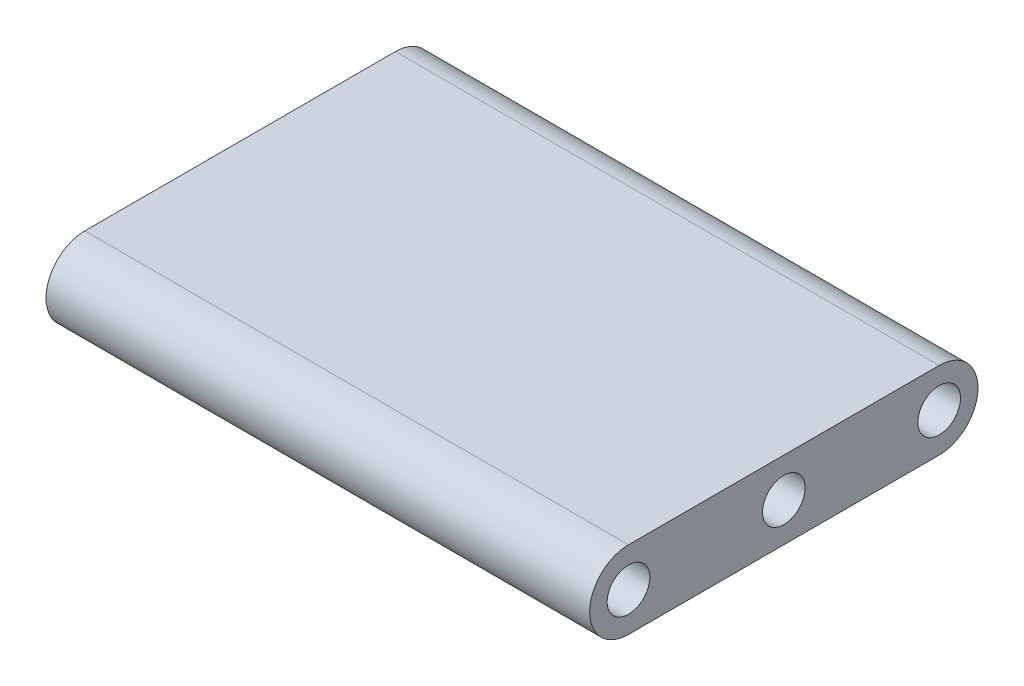
ISO-10303-21;
HEADER;
FILE_DESCRIPTION(('STEP AP214'),'2;1');
FILE_NAME('part.step','',(''),(''),'','','');
FILE_SCHEMA(('AUTOMOTIVE_DESIGN { 1 0 10303 214 1 1 1 1 }'));
ENDSEC;
DATA;
#1=APPLICATION_CONTEXT('core data for automotive mechanical design processes');
#2=APPLICATION_PROTOCOL_DEFINITION('international standard','automotive_design',2000,#1);
#3=PRODUCT_CONTEXT('',#1,'mechanical');
#4=PRODUCT('Part','Part','',(#3));
#5=PRODUCT_RELATED_PRODUCT_CATEGORY('part','',(#4));
#6=PRODUCT_DEFINITION_FORMATION('','',#4);
#7=PRODUCT_DEFINITION_CONTEXT('part definition',#1,'design');
#8=PRODUCT_DEFINITION('design','',#6,#7);
#9=PRODUCT_DEFINITION_SHAPE('','',#8);
#10=(LENGTH_UNIT() NAMED_UNIT(*) SI_UNIT(.MILLI.,.METRE.));
#11=(NAMED_UNIT(*) PLANE_ANGLE_UNIT() SI_UNIT($,.RADIAN.));
#12=(NAMED_UNIT(*) SI_UNIT($,.STERADIAN.) SOLID_ANGLE_UNIT());
#13=UNCERTAINTY_MEASURE_WITH_UNIT(LENGTH_MEASURE(1.E-05),#10,'distance_accuracy_value','');
#14=(GEOMETRIC_REPRESENTATION_CONTEXT(3) GLOBAL_UNCERTAINTY_ASSIGNED_CONTEXT((#13)) GLOBAL_UNIT_ASSIGNED_CONTEXT((#10,
#11,#12)) REPRESENTATION_CONTEXT('',''));
#15=CARTESIAN_POINT('',(0.,0.,0.));
#16=DIRECTION('',(0.,0.,1.));
#17=DIRECTION('',(1.,0.,0.));
#18=AXIS2_PLACEMENT_3D('',#15,#16,#17);
#19=CARTESIAN_POINT('',(44.45,-6.35000000000001,0.));
#20=DIRECTION('',(0.,1.,0.));
#21=DIRECTION('',(0.,0.,1.));
#22=AXIS2_PLACEMENT_3D('',#19,#20,#21);
#23=PLANE('',#22);
#24=DIRECTION('',(0.,0.,-1.));
#25=VECTOR('',#24,1.);
#26=CARTESIAN_POINT('',(-44.45,-6.35000000000001,0.));
#27=LINE('',#26,#25);
#28=CARTESIAN_POINT('',(-44.45,-6.35000000000001,25.4));
#29=VERTEX_POINT('',#28);
#30=CARTESIAN_POINT('',(-44.45,-6.35,-25.4));
#31=VERTEX_POINT('',#30);
#32=EDGE_CURVE('E117',#29,#31,#27,.T.);
#33=ORIENTED_EDGE('',*,*,#32,.T.);
#34=DIRECTION('',(-1.,0.,0.));
#35=VECTOR('',#34,1.);
#36=CARTESIAN_POINT('',(44.45,-6.35,-25.4));
#37=LINE('',#36,#35);
#38=CARTESIAN_POINT('',(44.45,-6.35,-25.4));
#39=VERTEX_POINT('',#38);
#40=EDGE_CURVE('E11',#39,#31,#37,.T.);
#41=ORIENTED_EDGE('',*,*,#40,.F.);
#42=DIRECTION('',(0.,0.,-1.));
#43=VECTOR('',#42,1.);
#44=CARTESIAN_POINT('',(44.45,-6.35000000000001,0.));
#45=LINE('',#44,#43);
#46=CARTESIAN_POINT('',(44.45,-6.35000000000001,25.4));
#47=VERTEX_POINT('',#46);
#48=EDGE_CURVE('E93',#47,#39,#45,.T.);
#49=ORIENTED_EDGE('',*,*,#48,.F.);
#50=DIRECTION('',(-1.,0.,0.));
#51=VECTOR('',#50,1.);
#52=CARTESIAN_POINT('',(44.45,-6.35000000000001,25.4));
#53=LINE('',#52,#51);
#54=EDGE_CURVE('E104',#47,#29,#53,.T.);
#55=ORIENTED_EDGE('',*,*,#54,.T.);
#56=EDGE_LOOP('',(#33,#41,#49,#55));
#57=FACE_BOUND('',#56,.T.);
#58=ADVANCED_FACE('F45',(#57),#23,.F.);
#59=CARTESIAN_POINT('',(44.45,0.,-25.4));
#60=DIRECTION('',(-1.,0.,0.));
#61=DIRECTION('',(0.,0.,1.));
#62=AXIS2_PLACEMENT_3D('',#59,#60,#61);
#63=CYLINDRICAL_SURFACE('',#62,6.35000000000001);
#64=CARTESIAN_POINT('',(-44.45,0.,-25.4));
#65=DIRECTION('',(1.,0.,0.));
#66=DIRECTION('',(0.,0.,-1.));
#67=AXIS2_PLACEMENT_3D('',#64,#65,#66);
#68=CIRCLE('',#67,6.35000000000001);
#69=CARTESIAN_POINT('',(-44.45,6.35,-25.4));
#70=VERTEX_POINT('',#69);
#71=EDGE_CURVE('E98',#31,#70,#68,.T.);
#72=ORIENTED_EDGE('',*,*,#71,.T.);
#73=DIRECTION('',(-1.,0.,0.));
#74=VECTOR('',#73,1.);
#75=CARTESIAN_POINT('',(44.45,6.35,-25.4));
#76=LINE('',#75,#74);
#77=CARTESIAN_POINT('',(44.45,6.35,-25.4));
#78=VERTEX_POINT('',#77);
#79=EDGE_CURVE('E54',#78,#70,#76,.T.);
#80=ORIENTED_EDGE('',*,*,#79,.F.);
#81=CARTESIAN_POINT('',(44.45,0.,-25.4));
#82=DIRECTION('',(1.,0.,0.));
#83=DIRECTION('',(0.,0.,-1.));
#84=AXIS2_PLACEMENT_3D('',#81,#82,#83);
#85=CIRCLE('',#84,6.35000000000001);
#86=EDGE_CURVE('E88',#39,#78,#85,.T.);
#87=ORIENTED_EDGE('',*,*,#86,.F.);
#88=ORIENTED_EDGE('',*,*,#40,.T.);
#89=EDGE_LOOP('',(#72,#80,#87,#88));
#90=FACE_BOUND('',#89,.T.);
#91=ADVANCED_FACE('F97',(#90),#63,.T.);
#92=CARTESIAN_POINT('',(44.45,6.35,0.));
#93=DIRECTION('',(0.,1.,0.));
#94=DIRECTION('',(0.,0.,1.));
#95=AXIS2_PLACEMENT_3D('',#92,#93,#94);
#96=PLANE('',#95);
#97=DIRECTION('',(0.,0.,-1.));
#98=VECTOR('',#97,1.);
#99=CARTESIAN_POINT('',(-44.45,6.35,0.));
#100=LINE('',#99,#98);
#101=CARTESIAN_POINT('',(-44.45,6.35000000000001,25.4));
#102=VERTEX_POINT('',#101);
#103=EDGE_CURVE('E121',#102,#70,#100,.T.);
#104=ORIENTED_EDGE('',*,*,#103,.F.);
#105=DIRECTION('',(-1.,0.,0.));
#106=VECTOR('',#105,1.);
#107=CARTESIAN_POINT('',(44.45,6.35000000000001,25.4));
#108=LINE('',#107,#106);
#109=CARTESIAN_POINT('',(44.45,6.35000000000001,25.4));
#110=VERTEX_POINT('',#109);
#111=EDGE_CURVE('E78',#110,#102,#108,.T.);
#112=ORIENTED_EDGE('',*,*,#111,.F.);
#113=DIRECTION('',(0.,0.,-1.));
#114=VECTOR('',#113,1.);
#115=CARTESIAN_POINT('',(44.45,6.35,0.));
#116=LINE('',#115,#114);
#117=EDGE_CURVE('E91',#110,#78,#116,.T.);
#118=ORIENTED_EDGE('',*,*,#117,.T.);
#119=ORIENTED_EDGE('',*,*,#79,.T.);
#120=EDGE_LOOP('',(#104,#112,#118,#119));
#121=FACE_BOUND('',#120,.T.);
#122=ADVANCED_FACE('F102',(#121),#96,.T.);
#123=CARTESIAN_POINT('',(44.45,0.,-25.4));
#124=DIRECTION('',(-1.,0.,0.));
#125=DIRECTION('',(0.,0.,1.));
#126=AXIS2_PLACEMENT_3D('',#123,#124,#125);
#127=CYLINDRICAL_SURFACE('',#126,3.4925);
#128=CARTESIAN_POINT('',(44.45,0.,-25.4));
#129=DIRECTION('',(1.,0.,0.));
#130=DIRECTION('',(0.,0.,-1.));
#131=AXIS2_PLACEMENT_3D('',#128,#129,#130);
#132=CIRCLE('',#131,3.4925);
#133=CARTESIAN_POINT('',(44.45,0.,-28.8925));
#134=VERTEX_POINT('',#133);
#135=EDGE_CURVE('E168',#134,#134,#132,.T.);
#136=ORIENTED_EDGE('',*,*,#135,.T.);
#137=EDGE_LOOP('',(#136));
#138=FACE_BOUND('',#137,.T.);
#139=CARTESIAN_POINT('',(-44.45,0.,-25.4));
#140=DIRECTION('',(1.,0.,0.));
#141=DIRECTION('',(0.,0.,-1.));
#142=AXIS2_PLACEMENT_3D('',#139,#140,#141);
#143=CIRCLE('',#142,3.4925);
#144=CARTESIAN_POINT('',(-44.45,0.,-28.8925));
#145=VERTEX_POINT('',#144);
#146=EDGE_CURVE('E114',#145,#145,#143,.T.);
#147=ORIENTED_EDGE('',*,*,#146,.F.);
#148=EDGE_LOOP('',(#147));
#149=FACE_BOUND('',#148,.T.);
#150=ADVANCED_FACE('F149',(#138,#149),#127,.F.);
#151=CARTESIAN_POINT('',(44.45,0.,25.4));
#152=DIRECTION('',(-1.,0.,0.));
#153=DIRECTION('',(0.,0.,1.));
#154=AXIS2_PLACEMENT_3D('',#151,#152,#153);
#155=CYLINDRICAL_SURFACE('',#154,3.4925);
#156=CARTESIAN_POINT('',(44.45,0.,25.4));
#157=DIRECTION('',(1.,0.,0.));
#158=DIRECTION('',(0.,0.,-1.));
#159=AXIS2_PLACEMENT_3D('',#156,#157,#158);
#160=CIRCLE('',#159,3.4925);
#161=CARTESIAN_POINT('',(44.45,0.,21.9075));
#162=VERTEX_POINT('',#161);
#163=EDGE_CURVE('E162',#162,#162,#160,.T.);
#164=ORIENTED_EDGE('',*,*,#163,.T.);
#165=EDGE_LOOP('',(#164));
#166=FACE_BOUND('',#165,.T.);
#167=CARTESIAN_POINT('',(-44.45,0.,25.4));
#168=DIRECTION('',(1.,0.,0.));
#169=DIRECTION('',(0.,0.,-1.));
#170=AXIS2_PLACEMENT_3D('',#167,#168,#169);
#171=CIRCLE('',#170,3.4925);
#172=CARTESIAN_POINT('',(-44.45,0.,21.9075));
#173=VERTEX_POINT('',#172);
#174=EDGE_CURVE('E111',#173,#173,#171,.T.);
#175=ORIENTED_EDGE('',*,*,#174,.F.);
#176=EDGE_LOOP('',(#175));
#177=FACE_BOUND('',#176,.T.);
#178=ADVANCED_FACE('F151',(#166,#177),#155,.F.);
#179=CARTESIAN_POINT('',(44.45,0.,0.));
#180=DIRECTION('',(-1.,0.,0.));
#181=DIRECTION('',(0.,0.,1.));
#182=AXIS2_PLACEMENT_3D('',#179,#180,#181);
#183=CYLINDRICAL_SURFACE('',#182,3.4925);
#184=CARTESIAN_POINT('',(44.45,0.,0.));
#185=DIRECTION('',(1.,0.,0.));
#186=DIRECTION('',(0.,0.,-1.));
#187=AXIS2_PLACEMENT_3D('',#184,#185,#186);
#188=CIRCLE('',#187,3.4925);
#189=CARTESIAN_POINT('',(44.45,0.,-3.49249999999999));
#190=VERTEX_POINT('',#189);
#191=EDGE_CURVE('E124',#190,#190,#188,.T.);
#192=ORIENTED_EDGE('',*,*,#191,.T.);
#193=EDGE_LOOP('',(#192));
#194=FACE_BOUND('',#193,.T.);
#195=CARTESIAN_POINT('',(-44.45,0.,0.));
#196=DIRECTION('',(1.,0.,0.));
#197=DIRECTION('',(0.,0.,-1.));
#198=AXIS2_PLACEMENT_3D('',#195,#196,#197);
#199=CIRCLE('',#198,3.4925);
#200=CARTESIAN_POINT('',(-44.45,0.,-3.49249999999999));
#201=VERTEX_POINT('',#200);
#202=EDGE_CURVE('E108',#201,#201,#199,.T.);
#203=ORIENTED_EDGE('',*,*,#202,.F.);
#204=EDGE_LOOP('',(#203));
#205=FACE_BOUND('',#204,.T.);
#206=ADVANCED_FACE('F47',(#194,#205),#183,.F.);
#207=CARTESIAN_POINT('',(44.45,0.,25.4));
#208=DIRECTION('',(-1.,0.,0.));
#209=DIRECTION('',(0.,0.,1.));
#210=AXIS2_PLACEMENT_3D('',#207,#208,#209);
#211=CYLINDRICAL_SURFACE('',#210,6.35);
#212=CARTESIAN_POINT('',(-44.45,0.,25.4));
#213=DIRECTION('',(1.,0.,0.));
#214=DIRECTION('',(0.,0.,-1.));
#215=AXIS2_PLACEMENT_3D('',#212,#213,#214);
#216=CIRCLE('',#215,6.35);
#217=EDGE_CURVE('E81',#102,#29,#216,.T.);
#218=ORIENTED_EDGE('',*,*,#217,.T.);
#219=ORIENTED_EDGE('',*,*,#54,.F.);
#220=CARTESIAN_POINT('',(44.45,0.,25.4));
#221=DIRECTION('',(1.,0.,0.));
#222=DIRECTION('',(0.,0.,-1.));
#223=AXIS2_PLACEMENT_3D('',#220,#221,#222);
#224=CIRCLE('',#223,6.35);
#225=EDGE_CURVE('E62',#110,#47,#224,.T.);
#226=ORIENTED_EDGE('',*,*,#225,.F.);
#227=ORIENTED_EDGE('',*,*,#111,.T.);
#228=EDGE_LOOP('',(#218,#219,#226,#227));
#229=FACE_BOUND('',#228,.T.);
#230=ADVANCED_FACE('F136',(#229),#211,.T.);
#231=CARTESIAN_POINT('',(44.45,0.,0.));
#232=DIRECTION('',(1.,0.,0.));
#233=DIRECTION('',(0.,0.,-1.));
#234=AXIS2_PLACEMENT_3D('',#231,#232,#233);
#235=PLANE('',#234);
#236=ORIENTED_EDGE('',*,*,#191,.F.);
#237=EDGE_LOOP('',(#236));
#238=FACE_BOUND('',#237,.T.);
#239=ORIENTED_EDGE('',*,*,#163,.F.);
#240=EDGE_LOOP('',(#239));
#241=FACE_BOUND('',#240,.T.);
#242=ORIENTED_EDGE('',*,*,#135,.F.);
#243=EDGE_LOOP('',(#242));
#244=FACE_BOUND('',#243,.T.);
#245=ORIENTED_EDGE('',*,*,#48,.T.);
#246=ORIENTED_EDGE('',*,*,#86,.T.);
#247=ORIENTED_EDGE('',*,*,#117,.F.);
#248=ORIENTED_EDGE('',*,*,#225,.T.);
#249=EDGE_LOOP('',(#245,#246,#247,#248));
#250=FACE_BOUND('',#249,.T.);
#251=ADVANCED_FACE('F89',(#238,#241,#244,#250),#235,.T.);
#252=CARTESIAN_POINT('',(-44.45,0.,0.));
#253=DIRECTION('',(1.,0.,0.));
#254=DIRECTION('',(0.,0.,-1.));
#255=AXIS2_PLACEMENT_3D('',#252,#253,#254);
#256=PLANE('',#255);
#257=ORIENTED_EDGE('',*,*,#202,.T.);
#258=EDGE_LOOP('',(#257));
#259=FACE_BOUND('',#258,.T.);
#260=ORIENTED_EDGE('',*,*,#174,.T.);
#261=EDGE_LOOP('',(#260));
#262=FACE_BOUND('',#261,.T.);
#263=ORIENTED_EDGE('',*,*,#146,.T.);
#264=EDGE_LOOP('',(#263));
#265=FACE_BOUND('',#264,.T.);
#266=ORIENTED_EDGE('',*,*,#32,.F.);
#267=ORIENTED_EDGE('',*,*,#217,.F.);
#268=ORIENTED_EDGE('',*,*,#103,.T.);
#269=ORIENTED_EDGE('',*,*,#71,.F.);
#270=EDGE_LOOP('',(#266,#267,#268,#269));
#271=FACE_BOUND('',#270,.T.);
#272=ADVANCED_FACE('F129',(#259,#262,#265,#271),#256,.F.);
#273=CLOSED_SHELL('',(#58,#91,#122,#150,#178,#206,#230,#251,#272));
#274=MANIFOLD_SOLID_BREP('B2',#273);
#275=ADVANCED_BREP_SHAPE_REPRESENTATION('',(#18,#274),#14);
#276=SHAPE_DEFINITION_REPRESENTATION(#9,#275);
ENDSEC;
END-ISO-10303-21;
